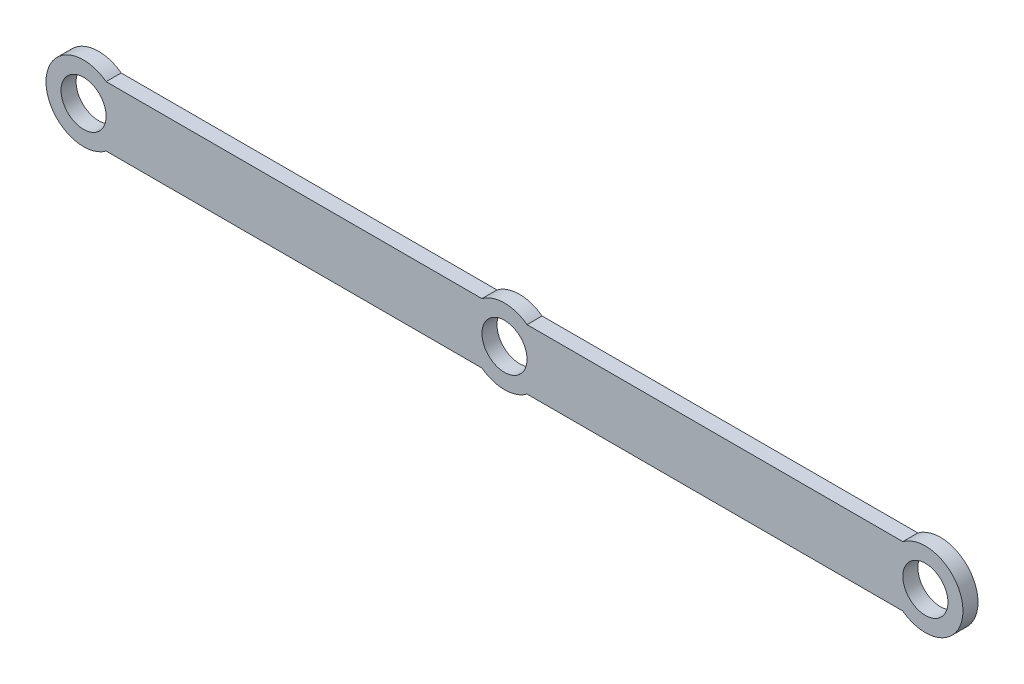
ISO-10303-21;
HEADER;
FILE_DESCRIPTION(('STEP AP214'),'2;1');
FILE_NAME('part.step','',(''),(''),'','','');
FILE_SCHEMA(('AUTOMOTIVE_DESIGN { 1 0 10303 214 1 1 1 1 }'));
ENDSEC;
DATA;
#1=APPLICATION_CONTEXT('core data for automotive mechanical design processes');
#2=APPLICATION_PROTOCOL_DEFINITION('international standard','automotive_design',2000,#1);
#3=PRODUCT_CONTEXT('',#1,'mechanical');
#4=PRODUCT('Part','Part','',(#3));
#5=PRODUCT_RELATED_PRODUCT_CATEGORY('part','',(#4));
#6=PRODUCT_DEFINITION_FORMATION('','',#4);
#7=PRODUCT_DEFINITION_CONTEXT('part definition',#1,'design');
#8=PRODUCT_DEFINITION('design','',#6,#7);
#9=PRODUCT_DEFINITION_SHAPE('','',#8);
#10=(LENGTH_UNIT() NAMED_UNIT(*) SI_UNIT(.MILLI.,.METRE.));
#11=(NAMED_UNIT(*) PLANE_ANGLE_UNIT() SI_UNIT($,.RADIAN.));
#12=(NAMED_UNIT(*) SI_UNIT($,.STERADIAN.) SOLID_ANGLE_UNIT());
#13=UNCERTAINTY_MEASURE_WITH_UNIT(LENGTH_MEASURE(1.E-05),#10,'distance_accuracy_value','');
#14=(GEOMETRIC_REPRESENTATION_CONTEXT(3) GLOBAL_UNCERTAINTY_ASSIGNED_CONTEXT((#13)) GLOBAL_UNIT_ASSIGNED_CONTEXT((#10,
#11,#12)) REPRESENTATION_CONTEXT('',''));
#15=CARTESIAN_POINT('',(0.,0.,0.));
#16=DIRECTION('',(0.,0.,1.));
#17=DIRECTION('',(1.,0.,0.));
#18=AXIS2_PLACEMENT_3D('',#15,#16,#17);
#19=CARTESIAN_POINT('',(28.,0.,1.));
#20=DIRECTION('',(0.,0.,1.));
#21=DIRECTION('',(1.,0.,0.));
#22=AXIS2_PLACEMENT_3D('',#19,#20,#21);
#23=PLANE('',#22);
#24=CARTESIAN_POINT('',(0.,0.,1.));
#25=DIRECTION('',(0.,0.,1.));
#26=DIRECTION('',(1.,0.,0.));
#27=AXIS2_PLACEMENT_3D('',#24,#25,#26);
#28=CIRCLE('',#27,1.5);
#29=CARTESIAN_POINT('',(1.5,0.,1.));
#30=VERTEX_POINT('',#29);
#31=EDGE_CURVE('E180',#30,#30,#28,.T.);
#32=ORIENTED_EDGE('',*,*,#31,.F.);
#33=EDGE_LOOP('',(#32));
#34=FACE_BOUND('',#33,.T.);
#35=CARTESIAN_POINT('',(28.,0.,1.));
#36=DIRECTION('',(0.,0.,1.));
#37=DIRECTION('',(1.,0.,0.));
#38=AXIS2_PLACEMENT_3D('',#35,#36,#37);
#39=CIRCLE('',#38,2.5);
#40=CARTESIAN_POINT('',(26.5,-2.,1.));
#41=VERTEX_POINT('',#40);
#42=CARTESIAN_POINT('',(26.5,2.,1.));
#43=VERTEX_POINT('',#42);
#44=EDGE_CURVE('E143',#41,#43,#39,.T.);
#45=ORIENTED_EDGE('',*,*,#44,.T.);
#46=DIRECTION('',(-1.,0.,0.));
#47=VECTOR('',#46,1.);
#48=CARTESIAN_POINT('',(1.5,2.,1.));
#49=LINE('',#48,#47);
#50=CARTESIAN_POINT('',(1.5,2.,1.));
#51=VERTEX_POINT('',#50);
#52=EDGE_CURVE('E91',#43,#51,#49,.T.);
#53=ORIENTED_EDGE('',*,*,#52,.T.);
#54=CARTESIAN_POINT('',(0.,0.,1.));
#55=DIRECTION('',(0.,0.,1.));
#56=DIRECTION('',(1.,0.,0.));
#57=AXIS2_PLACEMENT_3D('',#54,#55,#56);
#58=CIRCLE('',#57,2.5);
#59=CARTESIAN_POINT('',(-1.5,2.,1.));
#60=VERTEX_POINT('',#59);
#61=EDGE_CURVE('E158',#51,#60,#58,.T.);
#62=ORIENTED_EDGE('',*,*,#61,.T.);
#63=DIRECTION('',(-1.,0.,0.));
#64=VECTOR('',#63,1.);
#65=CARTESIAN_POINT('',(-26.5,2.,1.));
#66=LINE('',#65,#64);
#67=CARTESIAN_POINT('',(-26.5,2.,1.));
#68=VERTEX_POINT('',#67);
#69=EDGE_CURVE('E171',#60,#68,#66,.T.);
#70=ORIENTED_EDGE('',*,*,#69,.T.);
#71=CARTESIAN_POINT('',(-28.,0.,1.));
#72=DIRECTION('',(0.,0.,1.));
#73=DIRECTION('',(1.,0.,0.));
#74=AXIS2_PLACEMENT_3D('',#71,#72,#73);
#75=CIRCLE('',#74,2.5);
#76=CARTESIAN_POINT('',(-26.5,-2.,1.));
#77=VERTEX_POINT('',#76);
#78=EDGE_CURVE('E110',#68,#77,#75,.T.);
#79=ORIENTED_EDGE('',*,*,#78,.T.);
#80=DIRECTION('',(1.,0.,0.));
#81=VECTOR('',#80,1.);
#82=CARTESIAN_POINT('',(-26.5,-2.,1.));
#83=LINE('',#82,#81);
#84=CARTESIAN_POINT('',(-1.5,-2.,1.));
#85=VERTEX_POINT('',#84);
#86=EDGE_CURVE('E104',#77,#85,#83,.T.);
#87=ORIENTED_EDGE('',*,*,#86,.T.);
#88=CARTESIAN_POINT('',(0.,0.,1.));
#89=DIRECTION('',(0.,0.,1.));
#90=DIRECTION('',(1.,0.,0.));
#91=AXIS2_PLACEMENT_3D('',#88,#89,#90);
#92=CIRCLE('',#91,2.5);
#93=CARTESIAN_POINT('',(1.5,-2.,1.));
#94=VERTEX_POINT('',#93);
#95=EDGE_CURVE('E108',#85,#94,#92,.T.);
#96=ORIENTED_EDGE('',*,*,#95,.T.);
#97=DIRECTION('',(1.,0.,0.));
#98=VECTOR('',#97,1.);
#99=CARTESIAN_POINT('',(1.5,-2.,1.));
#100=LINE('',#99,#98);
#101=EDGE_CURVE('E48',#94,#41,#100,.T.);
#102=ORIENTED_EDGE('',*,*,#101,.T.);
#103=EDGE_LOOP('',(#45,#53,#62,#70,#79,#87,#96,#102));
#104=FACE_BOUND('',#103,.T.);
#105=CARTESIAN_POINT('',(-28.,0.,1.));
#106=DIRECTION('',(0.,0.,1.));
#107=DIRECTION('',(1.,0.,0.));
#108=AXIS2_PLACEMENT_3D('',#105,#106,#107);
#109=CIRCLE('',#108,1.5);
#110=CARTESIAN_POINT('',(-26.5,0.,1.));
#111=VERTEX_POINT('',#110);
#112=EDGE_CURVE('E132',#111,#111,#109,.T.);
#113=ORIENTED_EDGE('',*,*,#112,.F.);
#114=EDGE_LOOP('',(#113));
#115=FACE_BOUND('',#114,.T.);
#116=CARTESIAN_POINT('',(28.,0.,1.));
#117=DIRECTION('',(0.,0.,1.));
#118=DIRECTION('',(1.,0.,0.));
#119=AXIS2_PLACEMENT_3D('',#116,#117,#118);
#120=CIRCLE('',#119,1.5);
#121=CARTESIAN_POINT('',(29.5,0.,1.));
#122=VERTEX_POINT('',#121);
#123=EDGE_CURVE('E186',#122,#122,#120,.T.);
#124=ORIENTED_EDGE('',*,*,#123,.F.);
#125=EDGE_LOOP('',(#124));
#126=FACE_BOUND('',#125,.T.);
#127=ADVANCED_FACE('F31',(#34,#104,#115,#126),#23,.T.);
#128=CARTESIAN_POINT('',(28.,0.,0.));
#129=DIRECTION('',(0.,0.,1.));
#130=DIRECTION('',(1.,0.,0.));
#131=AXIS2_PLACEMENT_3D('',#128,#129,#130);
#132=PLANE('',#131);
#133=CARTESIAN_POINT('',(0.,0.,0.));
#134=DIRECTION('',(0.,0.,1.));
#135=DIRECTION('',(1.,0.,0.));
#136=AXIS2_PLACEMENT_3D('',#133,#134,#135);
#137=CIRCLE('',#136,1.5);
#138=CARTESIAN_POINT('',(1.5,0.,0.));
#139=VERTEX_POINT('',#138);
#140=EDGE_CURVE('E183',#139,#139,#137,.T.);
#141=ORIENTED_EDGE('',*,*,#140,.T.);
#142=EDGE_LOOP('',(#141));
#143=FACE_BOUND('',#142,.T.);
#144=CARTESIAN_POINT('',(28.,0.,0.));
#145=DIRECTION('',(0.,0.,1.));
#146=DIRECTION('',(1.,0.,0.));
#147=AXIS2_PLACEMENT_3D('',#144,#145,#146);
#148=CIRCLE('',#147,2.5);
#149=CARTESIAN_POINT('',(26.5,-2.,0.));
#150=VERTEX_POINT('',#149);
#151=CARTESIAN_POINT('',(26.5,2.,0.));
#152=VERTEX_POINT('',#151);
#153=EDGE_CURVE('E128',#150,#152,#148,.T.);
#154=ORIENTED_EDGE('',*,*,#153,.F.);
#155=DIRECTION('',(1.,0.,0.));
#156=VECTOR('',#155,1.);
#157=CARTESIAN_POINT('',(1.5,-2.,0.));
#158=LINE('',#157,#156);
#159=CARTESIAN_POINT('',(1.5,-2.,0.));
#160=VERTEX_POINT('',#159);
#161=EDGE_CURVE('E83',#160,#150,#158,.T.);
#162=ORIENTED_EDGE('',*,*,#161,.F.);
#163=CARTESIAN_POINT('',(0.,0.,0.));
#164=DIRECTION('',(0.,0.,1.));
#165=DIRECTION('',(1.,0.,0.));
#166=AXIS2_PLACEMENT_3D('',#163,#164,#165);
#167=CIRCLE('',#166,2.5);
#168=CARTESIAN_POINT('',(-1.5,-2.,0.));
#169=VERTEX_POINT('',#168);
#170=EDGE_CURVE('E77',#169,#160,#167,.T.);
#171=ORIENTED_EDGE('',*,*,#170,.F.);
#172=DIRECTION('',(1.,0.,0.));
#173=VECTOR('',#172,1.);
#174=CARTESIAN_POINT('',(-26.5,-2.,0.));
#175=LINE('',#174,#173);
#176=CARTESIAN_POINT('',(-26.5,-2.,0.));
#177=VERTEX_POINT('',#176);
#178=EDGE_CURVE('E118',#177,#169,#175,.T.);
#179=ORIENTED_EDGE('',*,*,#178,.F.);
#180=CARTESIAN_POINT('',(-28.,0.,0.));
#181=DIRECTION('',(0.,0.,1.));
#182=DIRECTION('',(1.,0.,0.));
#183=AXIS2_PLACEMENT_3D('',#180,#181,#182);
#184=CIRCLE('',#183,2.5);
#185=CARTESIAN_POINT('',(-26.5,2.,0.));
#186=VERTEX_POINT('',#185);
#187=EDGE_CURVE('E138',#186,#177,#184,.T.);
#188=ORIENTED_EDGE('',*,*,#187,.F.);
#189=DIRECTION('',(-1.,0.,0.));
#190=VECTOR('',#189,1.);
#191=CARTESIAN_POINT('',(-26.5,2.,0.));
#192=LINE('',#191,#190);
#193=CARTESIAN_POINT('',(-1.5,2.,0.));
#194=VERTEX_POINT('',#193);
#195=EDGE_CURVE('E136',#194,#186,#192,.T.);
#196=ORIENTED_EDGE('',*,*,#195,.F.);
#197=CARTESIAN_POINT('',(0.,0.,0.));
#198=DIRECTION('',(0.,0.,1.));
#199=DIRECTION('',(1.,0.,0.));
#200=AXIS2_PLACEMENT_3D('',#197,#198,#199);
#201=CIRCLE('',#200,2.5);
#202=CARTESIAN_POINT('',(1.5,2.,0.));
#203=VERTEX_POINT('',#202);
#204=EDGE_CURVE('E134',#203,#194,#201,.T.);
#205=ORIENTED_EDGE('',*,*,#204,.F.);
#206=DIRECTION('',(-1.,0.,0.));
#207=VECTOR('',#206,1.);
#208=CARTESIAN_POINT('',(1.5,2.,0.));
#209=LINE('',#208,#207);
#210=EDGE_CURVE('E131',#152,#203,#209,.T.);
#211=ORIENTED_EDGE('',*,*,#210,.F.);
#212=EDGE_LOOP('',(#154,#162,#171,#179,#188,#196,#205,#211));
#213=FACE_BOUND('',#212,.T.);
#214=CARTESIAN_POINT('',(-28.,0.,0.));
#215=DIRECTION('',(0.,0.,1.));
#216=DIRECTION('',(1.,0.,0.));
#217=AXIS2_PLACEMENT_3D('',#214,#215,#216);
#218=CIRCLE('',#217,1.5);
#219=CARTESIAN_POINT('',(-26.5,0.,0.));
#220=VERTEX_POINT('',#219);
#221=EDGE_CURVE('E177',#220,#220,#218,.T.);
#222=ORIENTED_EDGE('',*,*,#221,.T.);
#223=EDGE_LOOP('',(#222));
#224=FACE_BOUND('',#223,.T.);
#225=CARTESIAN_POINT('',(28.,0.,0.));
#226=DIRECTION('',(0.,0.,1.));
#227=DIRECTION('',(1.,0.,0.));
#228=AXIS2_PLACEMENT_3D('',#225,#226,#227);
#229=CIRCLE('',#228,1.5);
#230=CARTESIAN_POINT('',(29.5,0.,0.));
#231=VERTEX_POINT('',#230);
#232=EDGE_CURVE('E189',#231,#231,#229,.T.);
#233=ORIENTED_EDGE('',*,*,#232,.T.);
#234=EDGE_LOOP('',(#233));
#235=FACE_BOUND('',#234,.T.);
#236=ADVANCED_FACE('F162',(#143,#213,#224,#235),#132,.F.);
#237=CARTESIAN_POINT('',(28.,0.,1.));
#238=DIRECTION('',(0.,0.,-1.));
#239=DIRECTION('',(-1.,0.,0.));
#240=AXIS2_PLACEMENT_3D('',#237,#238,#239);
#241=CYLINDRICAL_SURFACE('',#240,2.5);
#242=ORIENTED_EDGE('',*,*,#153,.T.);
#243=DIRECTION('',(0.,0.,-1.));
#244=VECTOR('',#243,1.);
#245=CARTESIAN_POINT('',(26.5,2.,1.));
#246=LINE('',#245,#244);
#247=EDGE_CURVE('E11',#43,#152,#246,.T.);
#248=ORIENTED_EDGE('',*,*,#247,.F.);
#249=ORIENTED_EDGE('',*,*,#44,.F.);
#250=DIRECTION('',(0.,0.,-1.));
#251=VECTOR('',#250,1.);
#252=CARTESIAN_POINT('',(26.5,-2.,1.));
#253=LINE('',#252,#251);
#254=EDGE_CURVE('E124',#41,#150,#253,.T.);
#255=ORIENTED_EDGE('',*,*,#254,.T.);
#256=EDGE_LOOP('',(#242,#248,#249,#255));
#257=FACE_BOUND('',#256,.T.);
#258=ADVANCED_FACE('F33',(#257),#241,.T.);
#259=CARTESIAN_POINT('',(1.5,2.,1.));
#260=DIRECTION('',(0.,-1.,0.));
#261=DIRECTION('',(0.,0.,-1.));
#262=AXIS2_PLACEMENT_3D('',#259,#260,#261);
#263=PLANE('',#262);
#264=ORIENTED_EDGE('',*,*,#210,.T.);
#265=DIRECTION('',(0.,0.,-1.));
#266=VECTOR('',#265,1.);
#267=CARTESIAN_POINT('',(1.5,2.,1.));
#268=LINE('',#267,#266);
#269=EDGE_CURVE('E40',#51,#203,#268,.T.);
#270=ORIENTED_EDGE('',*,*,#269,.F.);
#271=ORIENTED_EDGE('',*,*,#52,.F.);
#272=ORIENTED_EDGE('',*,*,#247,.T.);
#273=EDGE_LOOP('',(#264,#270,#271,#272));
#274=FACE_BOUND('',#273,.T.);
#275=ADVANCED_FACE('F223',(#274),#263,.F.);
#276=CARTESIAN_POINT('',(0.,0.,1.));
#277=DIRECTION('',(0.,0.,-1.));
#278=DIRECTION('',(-1.,0.,0.));
#279=AXIS2_PLACEMENT_3D('',#276,#277,#278);
#280=CYLINDRICAL_SURFACE('',#279,2.5);
#281=ORIENTED_EDGE('',*,*,#204,.T.);
#282=DIRECTION('',(0.,0.,-1.));
#283=VECTOR('',#282,1.);
#284=CARTESIAN_POINT('',(-1.5,2.,1.));
#285=LINE('',#284,#283);
#286=EDGE_CURVE('E150',#60,#194,#285,.T.);
#287=ORIENTED_EDGE('',*,*,#286,.F.);
#288=ORIENTED_EDGE('',*,*,#61,.F.);
#289=ORIENTED_EDGE('',*,*,#269,.T.);
#290=EDGE_LOOP('',(#281,#287,#288,#289));
#291=FACE_BOUND('',#290,.T.);
#292=ADVANCED_FACE('F156',(#291),#280,.T.);
#293=CARTESIAN_POINT('',(-26.5,2.,1.));
#294=DIRECTION('',(0.,-1.,0.));
#295=DIRECTION('',(0.,0.,-1.));
#296=AXIS2_PLACEMENT_3D('',#293,#294,#295);
#297=PLANE('',#296);
#298=ORIENTED_EDGE('',*,*,#195,.T.);
#299=DIRECTION('',(0.,0.,-1.));
#300=VECTOR('',#299,1.);
#301=CARTESIAN_POINT('',(-26.5,2.,1.));
#302=LINE('',#301,#300);
#303=EDGE_CURVE('E147',#68,#186,#302,.T.);
#304=ORIENTED_EDGE('',*,*,#303,.F.);
#305=ORIENTED_EDGE('',*,*,#69,.F.);
#306=ORIENTED_EDGE('',*,*,#286,.T.);
#307=EDGE_LOOP('',(#298,#304,#305,#306));
#308=FACE_BOUND('',#307,.T.);
#309=ADVANCED_FACE('F167',(#308),#297,.F.);
#310=CARTESIAN_POINT('',(-28.,0.,1.));
#311=DIRECTION('',(0.,0.,-1.));
#312=DIRECTION('',(-1.,0.,0.));
#313=AXIS2_PLACEMENT_3D('',#310,#311,#312);
#314=CYLINDRICAL_SURFACE('',#313,2.5);
#315=ORIENTED_EDGE('',*,*,#187,.T.);
#316=DIRECTION('',(0.,0.,-1.));
#317=VECTOR('',#316,1.);
#318=CARTESIAN_POINT('',(-26.5,-2.,1.));
#319=LINE('',#318,#317);
#320=EDGE_CURVE('E119',#77,#177,#319,.T.);
#321=ORIENTED_EDGE('',*,*,#320,.F.);
#322=ORIENTED_EDGE('',*,*,#78,.F.);
#323=ORIENTED_EDGE('',*,*,#303,.T.);
#324=EDGE_LOOP('',(#315,#321,#322,#323));
#325=FACE_BOUND('',#324,.T.);
#326=ADVANCED_FACE('F170',(#325),#314,.T.);
#327=CARTESIAN_POINT('',(-26.5,-2.,1.));
#328=DIRECTION('',(0.,1.,0.));
#329=DIRECTION('',(0.,0.,1.));
#330=AXIS2_PLACEMENT_3D('',#327,#328,#329);
#331=PLANE('',#330);
#332=ORIENTED_EDGE('',*,*,#178,.T.);
#333=DIRECTION('',(0.,0.,-1.));
#334=VECTOR('',#333,1.);
#335=CARTESIAN_POINT('',(-1.5,-2.,1.));
#336=LINE('',#335,#334);
#337=EDGE_CURVE('E115',#85,#169,#336,.T.);
#338=ORIENTED_EDGE('',*,*,#337,.F.);
#339=ORIENTED_EDGE('',*,*,#86,.F.);
#340=ORIENTED_EDGE('',*,*,#320,.T.);
#341=EDGE_LOOP('',(#332,#338,#339,#340));
#342=FACE_BOUND('',#341,.T.);
#343=ADVANCED_FACE('F116',(#342),#331,.F.);
#344=CARTESIAN_POINT('',(0.,0.,1.));
#345=DIRECTION('',(0.,0.,-1.));
#346=DIRECTION('',(-1.,0.,0.));
#347=AXIS2_PLACEMENT_3D('',#344,#345,#346);
#348=CYLINDRICAL_SURFACE('',#347,2.5);
#349=ORIENTED_EDGE('',*,*,#170,.T.);
#350=DIRECTION('',(0.,0.,-1.));
#351=VECTOR('',#350,1.);
#352=CARTESIAN_POINT('',(1.5,-2.,1.));
#353=LINE('',#352,#351);
#354=EDGE_CURVE('E120',#94,#160,#353,.T.);
#355=ORIENTED_EDGE('',*,*,#354,.F.);
#356=ORIENTED_EDGE('',*,*,#95,.F.);
#357=ORIENTED_EDGE('',*,*,#337,.T.);
#358=EDGE_LOOP('',(#349,#355,#356,#357));
#359=FACE_BOUND('',#358,.T.);
#360=ADVANCED_FACE('F122',(#359),#348,.T.);
#361=CARTESIAN_POINT('',(1.5,-2.,1.));
#362=DIRECTION('',(0.,1.,0.));
#363=DIRECTION('',(0.,0.,1.));
#364=AXIS2_PLACEMENT_3D('',#361,#362,#363);
#365=PLANE('',#364);
#366=ORIENTED_EDGE('',*,*,#161,.T.);
#367=ORIENTED_EDGE('',*,*,#254,.F.);
#368=ORIENTED_EDGE('',*,*,#101,.F.);
#369=ORIENTED_EDGE('',*,*,#354,.T.);
#370=EDGE_LOOP('',(#366,#367,#368,#369));
#371=FACE_BOUND('',#370,.T.);
#372=ADVANCED_FACE('F211',(#371),#365,.F.);
#373=CARTESIAN_POINT('',(-28.,0.,1.));
#374=DIRECTION('',(0.,0.,-1.));
#375=DIRECTION('',(-1.,0.,0.));
#376=AXIS2_PLACEMENT_3D('',#373,#374,#375);
#377=CYLINDRICAL_SURFACE('',#376,1.5);
#378=ORIENTED_EDGE('',*,*,#112,.T.);
#379=EDGE_LOOP('',(#378));
#380=FACE_BOUND('',#379,.T.);
#381=ORIENTED_EDGE('',*,*,#221,.F.);
#382=EDGE_LOOP('',(#381));
#383=FACE_BOUND('',#382,.T.);
#384=ADVANCED_FACE('F208',(#380,#383),#377,.F.);
#385=CARTESIAN_POINT('',(0.,0.,1.));
#386=DIRECTION('',(0.,0.,-1.));
#387=DIRECTION('',(-1.,0.,0.));
#388=AXIS2_PLACEMENT_3D('',#385,#386,#387);
#389=CYLINDRICAL_SURFACE('',#388,1.5);
#390=ORIENTED_EDGE('',*,*,#31,.T.);
#391=EDGE_LOOP('',(#390));
#392=FACE_BOUND('',#391,.T.);
#393=ORIENTED_EDGE('',*,*,#140,.F.);
#394=EDGE_LOOP('',(#393));
#395=FACE_BOUND('',#394,.T.);
#396=ADVANCED_FACE('F287',(#392,#395),#389,.F.);
#397=CARTESIAN_POINT('',(28.,0.,1.));
#398=DIRECTION('',(0.,0.,-1.));
#399=DIRECTION('',(-1.,0.,0.));
#400=AXIS2_PLACEMENT_3D('',#397,#398,#399);
#401=CYLINDRICAL_SURFACE('',#400,1.5);
#402=ORIENTED_EDGE('',*,*,#123,.T.);
#403=EDGE_LOOP('',(#402));
#404=FACE_BOUND('',#403,.T.);
#405=ORIENTED_EDGE('',*,*,#232,.F.);
#406=EDGE_LOOP('',(#405));
#407=FACE_BOUND('',#406,.T.);
#408=ADVANCED_FACE('F195',(#404,#407),#401,.F.);
#409=CLOSED_SHELL('',(#127,#236,#258,#275,#292,#309,#326,#343,#360,#372,#384,#396,#408));
#410=MANIFOLD_SOLID_BREP('B2',#409);
#411=ADVANCED_BREP_SHAPE_REPRESENTATION('',(#18,#410),#14);
#412=SHAPE_DEFINITION_REPRESENTATION(#9,#411);
ENDSEC;
END-ISO-10303-21;
